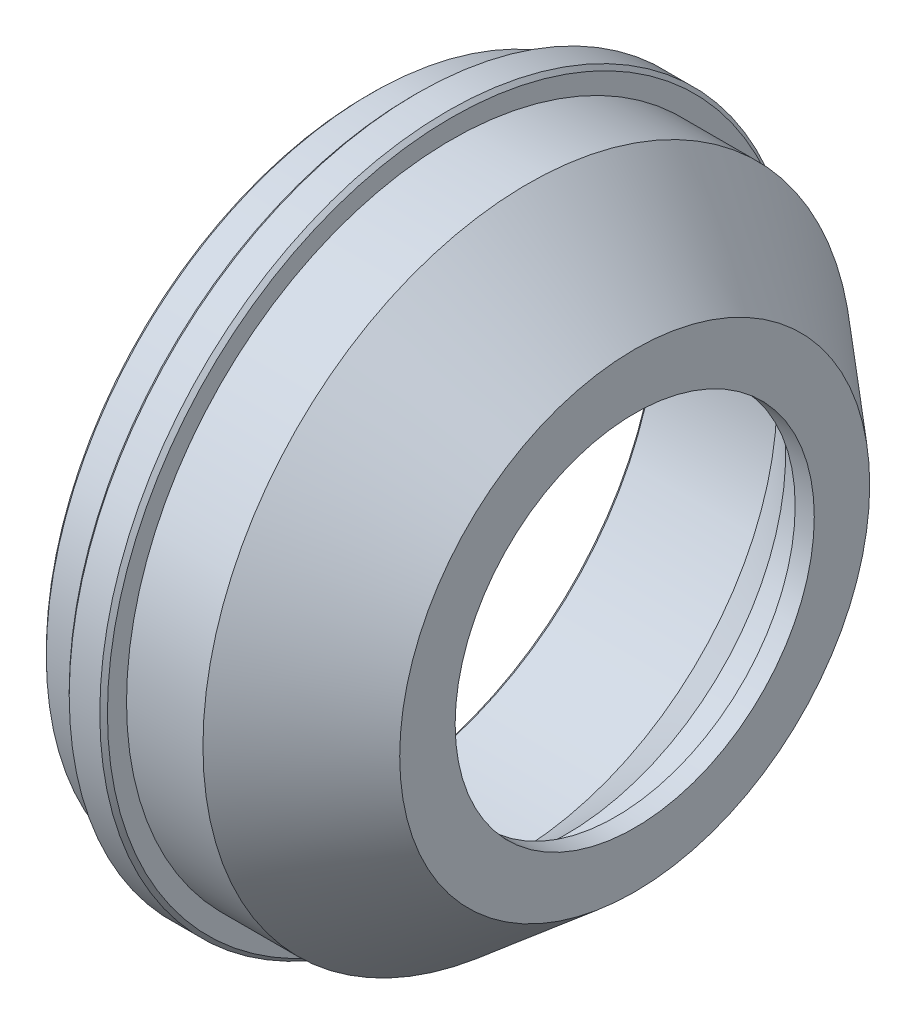
ISO-10303-21;
HEADER;
FILE_DESCRIPTION(('STEP AP214'),'2;1');
FILE_NAME('part.step','',(''),(''),'','','');
FILE_SCHEMA(('AUTOMOTIVE_DESIGN { 1 0 10303 214 1 1 1 1 }'));
ENDSEC;
DATA;
#1=APPLICATION_CONTEXT('core data for automotive mechanical design processes');
#2=APPLICATION_PROTOCOL_DEFINITION('international standard','automotive_design',2000,#1);
#3=PRODUCT_CONTEXT('',#1,'mechanical');
#4=PRODUCT('Part','Part','',(#3));
#5=PRODUCT_RELATED_PRODUCT_CATEGORY('part','',(#4));
#6=PRODUCT_DEFINITION_FORMATION('','',#4);
#7=PRODUCT_DEFINITION_CONTEXT('part definition',#1,'design');
#8=PRODUCT_DEFINITION('design','',#6,#7);
#9=PRODUCT_DEFINITION_SHAPE('','',#8);
#10=(LENGTH_UNIT() NAMED_UNIT(*) SI_UNIT(.MILLI.,.METRE.));
#11=(NAMED_UNIT(*) PLANE_ANGLE_UNIT() SI_UNIT($,.RADIAN.));
#12=(NAMED_UNIT(*) SI_UNIT($,.STERADIAN.) SOLID_ANGLE_UNIT());
#13=UNCERTAINTY_MEASURE_WITH_UNIT(LENGTH_MEASURE(1.E-05),#10,'distance_accuracy_value','');
#14=(GEOMETRIC_REPRESENTATION_CONTEXT(3) GLOBAL_UNCERTAINTY_ASSIGNED_CONTEXT((#13)) GLOBAL_UNIT_ASSIGNED_CONTEXT((#10,
#11,#12)) REPRESENTATION_CONTEXT('',''));
#15=CARTESIAN_POINT('',(0.,0.,0.));
#16=DIRECTION('',(0.,0.,1.));
#17=DIRECTION('',(1.,0.,0.));
#18=AXIS2_PLACEMENT_3D('',#15,#16,#17);
#19=CARTESIAN_POINT('',(70.,61.5052103270361,0.));
#20=DIRECTION('',(-1.,0.,0.));
#21=DIRECTION('',(0.,0.,1.));
#22=AXIS2_PLACEMENT_3D('',#19,#20,#21);
#23=PLANE('',#22);
#24=CARTESIAN_POINT('',(70.,0.,0.));
#25=DIRECTION('',(-1.,0.,0.));
#26=DIRECTION('',(0.,0.,1.));
#27=AXIS2_PLACEMENT_3D('',#24,#25,#26);
#28=CIRCLE('',#27,61.5052103270361);
#29=CARTESIAN_POINT('',(70.,0.,61.5052103270361));
#30=VERTEX_POINT('',#29);
#31=EDGE_CURVE('E102',#30,#30,#28,.T.);
#32=ORIENTED_EDGE('',*,*,#31,.F.);
#33=EDGE_LOOP('',(#32));
#34=FACE_BOUND('',#33,.T.);
#35=CARTESIAN_POINT('',(70.,0.,0.));
#36=DIRECTION('',(-1.,0.,0.));
#37=DIRECTION('',(0.,0.,1.));
#38=AXIS2_PLACEMENT_3D('',#35,#36,#37);
#39=CIRCLE('',#38,47.);
#40=CARTESIAN_POINT('',(70.,0.,47.));
#41=VERTEX_POINT('',#40);
#42=EDGE_CURVE('E81',#41,#41,#39,.T.);
#43=ORIENTED_EDGE('',*,*,#42,.T.);
#44=EDGE_LOOP('',(#43));
#45=FACE_BOUND('',#44,.T.);
#46=ADVANCED_FACE('F37',(#34,#45),#23,.F.);
#47=CARTESIAN_POINT('',(0.,0.,0.));
#48=DIRECTION('',(-1.,0.,0.));
#49=DIRECTION('',(0.,0.,1.));
#50=AXIS2_PLACEMENT_3D('',#47,#48,#49);
#51=CYLINDRICAL_SURFACE('',#50,47.);
#52=ORIENTED_EDGE('',*,*,#42,.F.);
#53=EDGE_LOOP('',(#52));
#54=FACE_BOUND('',#53,.T.);
#55=CARTESIAN_POINT('',(65.,0.,0.));
#56=DIRECTION('',(-1.,0.,0.));
#57=DIRECTION('',(0.,0.,1.));
#58=AXIS2_PLACEMENT_3D('',#55,#56,#57);
#59=CIRCLE('',#58,47.);
#60=CARTESIAN_POINT('',(65.,0.,47.));
#61=VERTEX_POINT('',#60);
#62=EDGE_CURVE('E84',#61,#61,#59,.T.);
#63=ORIENTED_EDGE('',*,*,#62,.T.);
#64=EDGE_LOOP('',(#63));
#65=FACE_BOUND('',#64,.T.);
#66=ADVANCED_FACE('F110',(#54,#65),#51,.F.);
#67=CARTESIAN_POINT('',(65.,47.,0.));
#68=DIRECTION('',(1.,0.,0.));
#69=DIRECTION('',(0.,0.,-1.));
#70=AXIS2_PLACEMENT_3D('',#67,#68,#69);
#71=PLANE('',#70);
#72=CARTESIAN_POINT('',(65.,0.,0.));
#73=DIRECTION('',(1.,0.,0.));
#74=DIRECTION('',(0.,0.,-1.));
#75=AXIS2_PLACEMENT_3D('',#72,#73,#74);
#76=CIRCLE('',#75,56.5);
#77=CARTESIAN_POINT('',(65.,0.,-56.5));
#78=VERTEX_POINT('',#77);
#79=EDGE_CURVE('E78',#78,#78,#76,.F.);
#80=ORIENTED_EDGE('',*,*,#79,.T.);
#81=EDGE_LOOP('',(#80));
#82=FACE_BOUND('',#81,.T.);
#83=ORIENTED_EDGE('',*,*,#62,.F.);
#84=EDGE_LOOP('',(#83));
#85=FACE_BOUND('',#84,.T.);
#86=ADVANCED_FACE('F116',(#82,#85),#71,.F.);
#87=CARTESIAN_POINT('',(0.,0.,0.));
#88=DIRECTION('',(-1.,0.,0.));
#89=DIRECTION('',(0.,0.,1.));
#90=AXIS2_PLACEMENT_3D('',#87,#88,#89);
#91=CYLINDRICAL_SURFACE('',#90,57.5);
#92=CARTESIAN_POINT('',(64.,0.,0.));
#93=DIRECTION('',(1.,0.,0.));
#94=DIRECTION('',(0.,0.,-1.));
#95=AXIS2_PLACEMENT_3D('',#92,#93,#94);
#96=CIRCLE('',#95,57.5);
#97=CARTESIAN_POINT('',(64.,0.,-57.5));
#98=VERTEX_POINT('',#97);
#99=EDGE_CURVE('E75',#98,#98,#96,.T.);
#100=ORIENTED_EDGE('',*,*,#99,.T.);
#101=EDGE_LOOP('',(#100));
#102=FACE_BOUND('',#101,.T.);
#103=CARTESIAN_POINT('',(52.,0.,0.));
#104=DIRECTION('',(-1.,0.,0.));
#105=DIRECTION('',(0.,0.,1.));
#106=AXIS2_PLACEMENT_3D('',#103,#104,#105);
#107=CIRCLE('',#106,57.5);
#108=CARTESIAN_POINT('',(52.,0.,57.5));
#109=VERTEX_POINT('',#108);
#110=EDGE_CURVE('E87',#109,#109,#107,.T.);
#111=ORIENTED_EDGE('',*,*,#110,.T.);
#112=EDGE_LOOP('',(#111));
#113=FACE_BOUND('',#112,.T.);
#114=ADVANCED_FACE('F121',(#102,#113),#91,.F.);
#115=CARTESIAN_POINT('',(38.,0.,0.));
#116=DIRECTION('',(-1.,0.,0.));
#117=DIRECTION('',(0.,0.,1.));
#118=AXIS2_PLACEMENT_3D('',#115,#116,#117);
#119=CONICAL_SURFACE('',#118,69.247394836482,0.698131700797733);
#120=ORIENTED_EDGE('',*,*,#110,.F.);
#121=EDGE_LOOP('',(#120));
#122=FACE_BOUND('',#121,.T.);
#123=CARTESIAN_POINT('',(38.,0.,0.));
#124=DIRECTION('',(-1.,0.,0.));
#125=DIRECTION('',(0.,0.,1.));
#126=AXIS2_PLACEMENT_3D('',#123,#124,#125);
#127=CIRCLE('',#126,69.247394836482);
#128=CARTESIAN_POINT('',(38.,0.,69.247394836482));
#129=VERTEX_POINT('',#128);
#130=EDGE_CURVE('E90',#129,#129,#127,.T.);
#131=ORIENTED_EDGE('',*,*,#130,.T.);
#132=EDGE_LOOP('',(#131));
#133=FACE_BOUND('',#132,.T.);
#134=ADVANCED_FACE('F127',(#122,#133),#119,.F.);
#135=CARTESIAN_POINT('',(38.,69.247394836482,0.));
#136=DIRECTION('',(1.,0.,0.));
#137=DIRECTION('',(0.,0.,-1.));
#138=AXIS2_PLACEMENT_3D('',#135,#136,#137);
#139=PLANE('',#138);
#140=CARTESIAN_POINT('',(38.,0.,0.));
#141=DIRECTION('',(1.,0.,0.));
#142=DIRECTION('',(0.,0.,-1.));
#143=AXIS2_PLACEMENT_3D('',#140,#141,#142);
#144=CIRCLE('',#143,74.);
#145=CARTESIAN_POINT('',(38.,0.,-74.));
#146=VERTEX_POINT('',#145);
#147=EDGE_CURVE('E72',#146,#146,#144,.F.);
#148=ORIENTED_EDGE('',*,*,#147,.T.);
#149=EDGE_LOOP('',(#148));
#150=FACE_BOUND('',#149,.T.);
#151=ORIENTED_EDGE('',*,*,#130,.F.);
#152=EDGE_LOOP('',(#151));
#153=FACE_BOUND('',#152,.T.);
#154=ADVANCED_FACE('F161',(#150,#153),#139,.F.);
#155=CARTESIAN_POINT('',(0.,0.,0.));
#156=DIRECTION('',(-1.,0.,0.));
#157=DIRECTION('',(0.,0.,1.));
#158=AXIS2_PLACEMENT_3D('',#155,#156,#157);
#159=CYLINDRICAL_SURFACE('',#158,75.);
#160=CARTESIAN_POINT('',(0.999999999999973,0.,0.));
#161=DIRECTION('',(1.,0.,0.));
#162=DIRECTION('',(0.,0.,-1.));
#163=AXIS2_PLACEMENT_3D('',#160,#161,#162);
#164=CIRCLE('',#163,75.);
#165=CARTESIAN_POINT('',(0.999999999999973,0.,-75.));
#166=VERTEX_POINT('',#165);
#167=EDGE_CURVE('E52',#166,#166,#164,.F.);
#168=ORIENTED_EDGE('',*,*,#167,.T.);
#169=EDGE_LOOP('',(#168));
#170=FACE_BOUND('',#169,.T.);
#171=CARTESIAN_POINT('',(37.,0.,0.));
#172=DIRECTION('',(1.,0.,0.));
#173=DIRECTION('',(0.,0.,-1.));
#174=AXIS2_PLACEMENT_3D('',#171,#172,#173);
#175=CIRCLE('',#174,75.);
#176=CARTESIAN_POINT('',(37.,0.,-75.));
#177=VERTEX_POINT('',#176);
#178=EDGE_CURVE('E69',#177,#177,#175,.T.);
#179=ORIENTED_EDGE('',*,*,#178,.T.);
#180=EDGE_LOOP('',(#179));
#181=FACE_BOUND('',#180,.T.);
#182=ADVANCED_FACE('F157',(#170,#181),#159,.F.);
#183=CARTESIAN_POINT('',(0.,75.,0.));
#184=DIRECTION('',(1.,0.,0.));
#185=DIRECTION('',(0.,0.,-1.));
#186=AXIS2_PLACEMENT_3D('',#183,#184,#185);
#187=PLANE('',#186);
#188=CARTESIAN_POINT('',(0.,0.,0.));
#189=DIRECTION('',(1.,0.,0.));
#190=DIRECTION('',(0.,0.,-1.));
#191=AXIS2_PLACEMENT_3D('',#188,#189,#190);
#192=CIRCLE('',#191,75.9999999999999);
#193=CARTESIAN_POINT('',(0.,0.,-75.9999999999999));
#194=VERTEX_POINT('',#193);
#195=EDGE_CURVE('E44',#194,#194,#192,.T.);
#196=ORIENTED_EDGE('',*,*,#195,.T.);
#197=EDGE_LOOP('',(#196));
#198=FACE_BOUND('',#197,.T.);
#199=CARTESIAN_POINT('',(0.,0.,0.));
#200=DIRECTION('',(1.,0.,0.));
#201=DIRECTION('',(0.,0.,-1.));
#202=AXIS2_PLACEMENT_3D('',#199,#200,#201);
#203=CIRCLE('',#202,84.);
#204=CARTESIAN_POINT('',(0.,0.,-84.));
#205=VERTEX_POINT('',#204);
#206=EDGE_CURVE('E48',#205,#205,#203,.F.);
#207=ORIENTED_EDGE('',*,*,#206,.T.);
#208=EDGE_LOOP('',(#207));
#209=FACE_BOUND('',#208,.T.);
#210=ADVANCED_FACE('F160',(#198,#209),#187,.F.);
#211=CARTESIAN_POINT('',(0.,0.,0.));
#212=DIRECTION('',(-1.,0.,0.));
#213=DIRECTION('',(0.,0.,1.));
#214=AXIS2_PLACEMENT_3D('',#211,#212,#213);
#215=CYLINDRICAL_SURFACE('',#214,85.);
#216=CARTESIAN_POINT('',(1.,0.,0.));
#217=DIRECTION('',(1.,0.,0.));
#218=DIRECTION('',(0.,0.,-1.));
#219=AXIS2_PLACEMENT_3D('',#216,#217,#218);
#220=CIRCLE('',#219,85.);
#221=CARTESIAN_POINT('',(1.,0.,-85.));
#222=VERTEX_POINT('',#221);
#223=EDGE_CURVE('E10',#222,#222,#220,.T.);
#224=ORIENTED_EDGE('',*,*,#223,.T.);
#225=EDGE_LOOP('',(#224));
#226=FACE_BOUND('',#225,.T.);
#227=CARTESIAN_POINT('',(12.,0.,0.));
#228=DIRECTION('',(-1.,0.,0.));
#229=DIRECTION('',(0.,0.,1.));
#230=AXIS2_PLACEMENT_3D('',#227,#228,#229);
#231=CIRCLE('',#230,85.);
#232=CARTESIAN_POINT('',(12.,0.,85.));
#233=VERTEX_POINT('',#232);
#234=EDGE_CURVE('E93',#233,#233,#231,.T.);
#235=ORIENTED_EDGE('',*,*,#234,.T.);
#236=EDGE_LOOP('',(#235));
#237=FACE_BOUND('',#236,.T.);
#238=ADVANCED_FACE('F180',(#226,#237),#215,.T.);
#239=CARTESIAN_POINT('',(12.,85.,0.));
#240=DIRECTION('',(1.,0.,0.));
#241=DIRECTION('',(0.,0.,-1.));
#242=AXIS2_PLACEMENT_3D('',#239,#240,#241);
#243=PLANE('',#242);
#244=CARTESIAN_POINT('',(12.,0.,0.));
#245=DIRECTION('',(1.,0.,0.));
#246=DIRECTION('',(0.,0.,-1.));
#247=AXIS2_PLACEMENT_3D('',#244,#245,#246);
#248=CIRCLE('',#247,90.);
#249=CARTESIAN_POINT('',(12.,0.,-90.));
#250=VERTEX_POINT('',#249);
#251=EDGE_CURVE('E57',#250,#250,#248,.F.);
#252=ORIENTED_EDGE('',*,*,#251,.T.);
#253=EDGE_LOOP('',(#252));
#254=FACE_BOUND('',#253,.T.);
#255=ORIENTED_EDGE('',*,*,#234,.F.);
#256=EDGE_LOOP('',(#255));
#257=FACE_BOUND('',#256,.T.);
#258=ADVANCED_FACE('F183',(#254,#257),#243,.F.);
#259=CARTESIAN_POINT('',(0.,0.,0.));
#260=DIRECTION('',(-1.,0.,0.));
#261=DIRECTION('',(0.,0.,1.));
#262=AXIS2_PLACEMENT_3D('',#259,#260,#261);
#263=CYLINDRICAL_SURFACE('',#262,91.);
#264=CARTESIAN_POINT('',(21.,0.,0.));
#265=DIRECTION('',(-1.,0.,0.));
#266=DIRECTION('',(0.,0.,1.));
#267=AXIS2_PLACEMENT_3D('',#264,#265,#266);
#268=CIRCLE('',#267,91.);
#269=CARTESIAN_POINT('',(21.,0.,91.));
#270=VERTEX_POINT('',#269);
#271=EDGE_CURVE('E63',#270,#270,#268,.T.);
#272=ORIENTED_EDGE('',*,*,#271,.T.);
#273=EDGE_LOOP('',(#272));
#274=FACE_BOUND('',#273,.T.);
#275=CARTESIAN_POINT('',(13.,0.,0.));
#276=DIRECTION('',(1.,0.,0.));
#277=DIRECTION('',(0.,0.,-1.));
#278=AXIS2_PLACEMENT_3D('',#275,#276,#277);
#279=CIRCLE('',#278,91.);
#280=CARTESIAN_POINT('',(13.,0.,-91.));
#281=VERTEX_POINT('',#280);
#282=EDGE_CURVE('E66',#281,#281,#279,.T.);
#283=ORIENTED_EDGE('',*,*,#282,.T.);
#284=EDGE_LOOP('',(#283));
#285=FACE_BOUND('',#284,.T.);
#286=ADVANCED_FACE('F186',(#274,#285),#263,.T.);
#287=CARTESIAN_POINT('',(22.,91.,0.));
#288=DIRECTION('',(-1.,0.,0.));
#289=DIRECTION('',(0.,0.,1.));
#290=AXIS2_PLACEMENT_3D('',#287,#288,#289);
#291=PLANE('',#290);
#292=CARTESIAN_POINT('',(22.,0.,0.));
#293=DIRECTION('',(-1.,0.,0.));
#294=DIRECTION('',(0.,0.,1.));
#295=AXIS2_PLACEMENT_3D('',#292,#293,#294);
#296=CIRCLE('',#295,90.);
#297=CARTESIAN_POINT('',(22.,0.,90.));
#298=VERTEX_POINT('',#297);
#299=EDGE_CURVE('E60',#298,#298,#296,.F.);
#300=ORIENTED_EDGE('',*,*,#299,.T.);
#301=EDGE_LOOP('',(#300));
#302=FACE_BOUND('',#301,.T.);
#303=CARTESIAN_POINT('',(22.,0.,0.));
#304=DIRECTION('',(-1.,0.,0.));
#305=DIRECTION('',(0.,0.,1.));
#306=AXIS2_PLACEMENT_3D('',#303,#304,#305);
#307=CIRCLE('',#306,85.);
#308=CARTESIAN_POINT('',(22.,0.,85.));
#309=VERTEX_POINT('',#308);
#310=EDGE_CURVE('E96',#309,#309,#307,.T.);
#311=ORIENTED_EDGE('',*,*,#310,.T.);
#312=EDGE_LOOP('',(#311));
#313=FACE_BOUND('',#312,.T.);
#314=ADVANCED_FACE('F190',(#302,#313),#291,.F.);
#315=CARTESIAN_POINT('',(0.,0.,0.));
#316=DIRECTION('',(-1.,0.,0.));
#317=DIRECTION('',(0.,0.,1.));
#318=AXIS2_PLACEMENT_3D('',#315,#316,#317);
#319=CYLINDRICAL_SURFACE('',#318,85.);
#320=ORIENTED_EDGE('',*,*,#310,.F.);
#321=EDGE_LOOP('',(#320));
#322=FACE_BOUND('',#321,.T.);
#323=CARTESIAN_POINT('',(42.,0.,0.));
#324=DIRECTION('',(-1.,0.,0.));
#325=DIRECTION('',(0.,0.,1.));
#326=AXIS2_PLACEMENT_3D('',#323,#324,#325);
#327=CIRCLE('',#326,85.);
#328=CARTESIAN_POINT('',(42.,0.,85.));
#329=VERTEX_POINT('',#328);
#330=EDGE_CURVE('E99',#329,#329,#327,.T.);
#331=ORIENTED_EDGE('',*,*,#330,.T.);
#332=EDGE_LOOP('',(#331));
#333=FACE_BOUND('',#332,.T.);
#334=ADVANCED_FACE('F194',(#322,#333),#319,.T.);
#335=CARTESIAN_POINT('',(70.,0.,0.));
#336=DIRECTION('',(-1.,0.,0.));
#337=DIRECTION('',(0.,0.,1.));
#338=AXIS2_PLACEMENT_3D('',#335,#336,#337);
#339=CONICAL_SURFACE('',#338,61.5052103270361,0.698131700797734);
#340=ORIENTED_EDGE('',*,*,#330,.F.);
#341=EDGE_LOOP('',(#340));
#342=FACE_BOUND('',#341,.T.);
#343=ORIENTED_EDGE('',*,*,#31,.T.);
#344=EDGE_LOOP('',(#343));
#345=FACE_BOUND('',#344,.T.);
#346=ADVANCED_FACE('F106',(#342,#345),#339,.T.);
#347=CARTESIAN_POINT('',(64.,0.,0.));
#348=DIRECTION('',(1.,0.,0.));
#349=DIRECTION('',(0.,0.,-1.));
#350=AXIS2_PLACEMENT_3D('',#347,#348,#349);
#351=TOROIDAL_SURFACE('',#350,56.5,1.);
#352=ORIENTED_EDGE('',*,*,#99,.F.);
#353=EDGE_LOOP('',(#352));
#354=FACE_BOUND('',#353,.T.);
#355=ORIENTED_EDGE('',*,*,#79,.F.);
#356=EDGE_LOOP('',(#355));
#357=FACE_BOUND('',#356,.T.);
#358=ADVANCED_FACE('F132',(#354,#357),#351,.F.);
#359=CARTESIAN_POINT('',(37.,0.,0.));
#360=DIRECTION('',(1.,0.,0.));
#361=DIRECTION('',(0.,0.,-1.));
#362=AXIS2_PLACEMENT_3D('',#359,#360,#361);
#363=TOROIDAL_SURFACE('',#362,74.,1.);
#364=ORIENTED_EDGE('',*,*,#178,.F.);
#365=EDGE_LOOP('',(#364));
#366=FACE_BOUND('',#365,.T.);
#367=ORIENTED_EDGE('',*,*,#147,.F.);
#368=EDGE_LOOP('',(#367));
#369=FACE_BOUND('',#368,.T.);
#370=ADVANCED_FACE('F135',(#366,#369),#363,.F.);
#371=CARTESIAN_POINT('',(21.,0.,0.));
#372=DIRECTION('',(-1.,0.,0.));
#373=DIRECTION('',(0.,0.,1.));
#374=AXIS2_PLACEMENT_3D('',#371,#372,#373);
#375=CONICAL_SURFACE('',#374,91.,0.785398163397441);
#376=ORIENTED_EDGE('',*,*,#299,.F.);
#377=EDGE_LOOP('',(#376));
#378=FACE_BOUND('',#377,.T.);
#379=ORIENTED_EDGE('',*,*,#271,.F.);
#380=EDGE_LOOP('',(#379));
#381=FACE_BOUND('',#380,.T.);
#382=ADVANCED_FACE('F139',(#378,#381),#375,.T.);
#383=CARTESIAN_POINT('',(12.,0.,0.));
#384=DIRECTION('',(1.,0.,0.));
#385=DIRECTION('',(0.,0.,-1.));
#386=AXIS2_PLACEMENT_3D('',#383,#384,#385);
#387=CONICAL_SURFACE('',#386,90.,0.785398163397462);
#388=ORIENTED_EDGE('',*,*,#282,.F.);
#389=EDGE_LOOP('',(#388));
#390=FACE_BOUND('',#389,.T.);
#391=ORIENTED_EDGE('',*,*,#251,.F.);
#392=EDGE_LOOP('',(#391));
#393=FACE_BOUND('',#392,.T.);
#394=ADVANCED_FACE('F143',(#390,#393),#387,.T.);
#395=CARTESIAN_POINT('',(0.999999999999973,0.,0.));
#396=DIRECTION('',(-1.,0.,0.));
#397=DIRECTION('',(0.,0.,1.));
#398=AXIS2_PLACEMENT_3D('',#395,#396,#397);
#399=CONICAL_SURFACE('',#398,75.,0.785398163397435);
#400=ORIENTED_EDGE('',*,*,#195,.F.);
#401=EDGE_LOOP('',(#400));
#402=FACE_BOUND('',#401,.T.);
#403=ORIENTED_EDGE('',*,*,#167,.F.);
#404=EDGE_LOOP('',(#403));
#405=FACE_BOUND('',#404,.T.);
#406=ADVANCED_FACE('F146',(#402,#405),#399,.F.);
#407=CARTESIAN_POINT('',(0.,0.,0.));
#408=DIRECTION('',(1.,0.,0.));
#409=DIRECTION('',(0.,0.,-1.));
#410=AXIS2_PLACEMENT_3D('',#407,#408,#409);
#411=CONICAL_SURFACE('',#410,84.,0.785398163397455);
#412=ORIENTED_EDGE('',*,*,#223,.F.);
#413=EDGE_LOOP('',(#412));
#414=FACE_BOUND('',#413,.T.);
#415=ORIENTED_EDGE('',*,*,#206,.F.);
#416=EDGE_LOOP('',(#415));
#417=FACE_BOUND('',#416,.T.);
#418=ADVANCED_FACE('F39',(#414,#417),#411,.T.);
#419=CLOSED_SHELL('',(#46,#66,#86,#114,#134,#154,#182,#210,#238,#258,#286,#314,#334,#346,#358,
#370,#382,#394,#406,#418));
#420=MANIFOLD_SOLID_BREP('B2',#419);
#421=ADVANCED_BREP_SHAPE_REPRESENTATION('',(#18,#420),#14);
#422=SHAPE_DEFINITION_REPRESENTATION(#9,#421);
ENDSEC;
END-ISO-10303-21;
